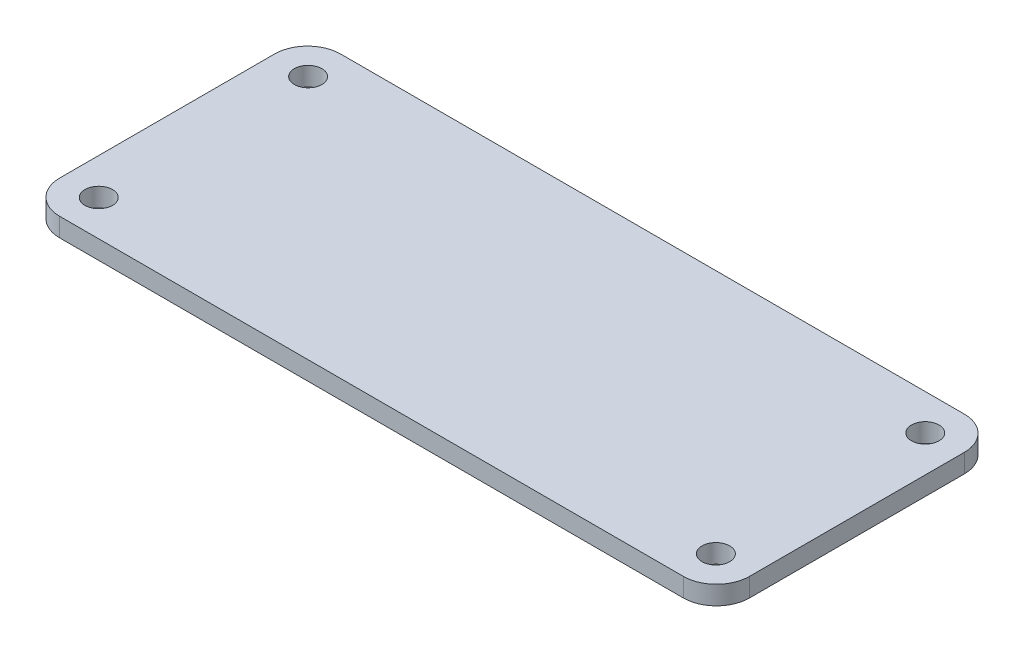
ISO-10303-21;
HEADER;
FILE_DESCRIPTION(('STEP AP214'),'2;1');
FILE_NAME('part.step','',(''),(''),'','','');
FILE_SCHEMA(('AUTOMOTIVE_DESIGN { 1 0 10303 214 1 1 1 1 }'));
ENDSEC;
DATA;
#1=APPLICATION_CONTEXT('core data for automotive mechanical design processes');
#2=APPLICATION_PROTOCOL_DEFINITION('international standard','automotive_design',2000,#1);
#3=PRODUCT_CONTEXT('',#1,'mechanical');
#4=PRODUCT('Part','Part','',(#3));
#5=PRODUCT_RELATED_PRODUCT_CATEGORY('part','',(#4));
#6=PRODUCT_DEFINITION_FORMATION('','',#4);
#7=PRODUCT_DEFINITION_CONTEXT('part definition',#1,'design');
#8=PRODUCT_DEFINITION('design','',#6,#7);
#9=PRODUCT_DEFINITION_SHAPE('','',#8);
#10=(LENGTH_UNIT() NAMED_UNIT(*) SI_UNIT(.MILLI.,.METRE.));
#11=(NAMED_UNIT(*) PLANE_ANGLE_UNIT() SI_UNIT($,.RADIAN.));
#12=(NAMED_UNIT(*) SI_UNIT($,.STERADIAN.) SOLID_ANGLE_UNIT());
#13=UNCERTAINTY_MEASURE_WITH_UNIT(LENGTH_MEASURE(1.E-05),#10,'distance_accuracy_value','');
#14=(GEOMETRIC_REPRESENTATION_CONTEXT(3) GLOBAL_UNCERTAINTY_ASSIGNED_CONTEXT((#13)) GLOBAL_UNIT_ASSIGNED_CONTEXT((#10,
#11,#12)) REPRESENTATION_CONTEXT('',''));
#15=CARTESIAN_POINT('',(0.,0.,0.));
#16=DIRECTION('',(0.,0.,1.));
#17=DIRECTION('',(1.,0.,0.));
#18=AXIS2_PLACEMENT_3D('',#15,#16,#17);
#19=CARTESIAN_POINT('',(0.,1.7,0.));
#20=DIRECTION('',(0.,1.,0.));
#21=DIRECTION('',(0.,0.,1.));
#22=AXIS2_PLACEMENT_3D('',#19,#20,#21);
#23=PLANE('',#22);
#24=CARTESIAN_POINT('',(28.,1.7,9.5));
#25=DIRECTION('',(0.,1.,0.));
#26=DIRECTION('',(0.,0.,1.));
#27=AXIS2_PLACEMENT_3D('',#24,#25,#26);
#28=CIRCLE('',#27,1.25);
#29=CARTESIAN_POINT('',(28.,1.7,10.75));
#30=VERTEX_POINT('',#29);
#31=EDGE_CURVE('E224',#30,#30,#28,.T.);
#32=ORIENTED_EDGE('',*,*,#31,.F.);
#33=EDGE_LOOP('',(#32));
#34=FACE_BOUND('',#33,.T.);
#35=CARTESIAN_POINT('',(-28.,1.7,-9.5));
#36=DIRECTION('',(0.,1.,0.));
#37=DIRECTION('',(0.,0.,1.));
#38=AXIS2_PLACEMENT_3D('',#35,#36,#37);
#39=CIRCLE('',#38,1.25);
#40=CARTESIAN_POINT('',(-28.,1.7,-8.25));
#41=VERTEX_POINT('',#40);
#42=EDGE_CURVE('E146',#41,#41,#39,.T.);
#43=ORIENTED_EDGE('',*,*,#42,.F.);
#44=EDGE_LOOP('',(#43));
#45=FACE_BOUND('',#44,.T.);
#46=DIRECTION('',(0.,0.,-1.));
#47=VECTOR('',#46,1.);
#48=CARTESIAN_POINT('',(31.3,1.7,-12.75));
#49=LINE('',#48,#47);
#50=CARTESIAN_POINT('',(31.3,1.7,9.75));
#51=VERTEX_POINT('',#50);
#52=CARTESIAN_POINT('',(31.3,1.7,-9.75000000000001));
#53=VERTEX_POINT('',#52);
#54=EDGE_CURVE('E152',#51,#53,#49,.T.);
#55=ORIENTED_EDGE('',*,*,#54,.T.);
#56=CARTESIAN_POINT('',(28.3,1.7,-9.75000000000001));
#57=DIRECTION('',(0.,1.,0.));
#58=DIRECTION('',(0.,0.,1.));
#59=AXIS2_PLACEMENT_3D('',#56,#57,#58);
#60=CIRCLE('',#59,3.);
#61=CARTESIAN_POINT('',(28.3,1.7,-12.75));
#62=VERTEX_POINT('',#61);
#63=EDGE_CURVE('E175',#53,#62,#60,.T.);
#64=ORIENTED_EDGE('',*,*,#63,.T.);
#65=DIRECTION('',(-1.,0.,0.));
#66=VECTOR('',#65,1.);
#67=CARTESIAN_POINT('',(-31.3,1.7,-12.75));
#68=LINE('',#67,#66);
#69=CARTESIAN_POINT('',(-28.3,1.7,-12.75));
#70=VERTEX_POINT('',#69);
#71=EDGE_CURVE('E128',#62,#70,#68,.T.);
#72=ORIENTED_EDGE('',*,*,#71,.T.);
#73=CARTESIAN_POINT('',(-28.3,1.7,-9.75000000000001));
#74=DIRECTION('',(0.,1.,0.));
#75=DIRECTION('',(0.,0.,1.));
#76=AXIS2_PLACEMENT_3D('',#73,#74,#75);
#77=CIRCLE('',#76,3.);
#78=CARTESIAN_POINT('',(-31.3,1.7,-9.75000000000001));
#79=VERTEX_POINT('',#78);
#80=EDGE_CURVE('E169',#70,#79,#77,.T.);
#81=ORIENTED_EDGE('',*,*,#80,.T.);
#82=DIRECTION('',(0.,0.,1.));
#83=VECTOR('',#82,1.);
#84=CARTESIAN_POINT('',(-31.3,1.7,-12.75));
#85=LINE('',#84,#83);
#86=CARTESIAN_POINT('',(-31.3,1.7,9.75));
#87=VERTEX_POINT('',#86);
#88=EDGE_CURVE('E188',#79,#87,#85,.T.);
#89=ORIENTED_EDGE('',*,*,#88,.T.);
#90=CARTESIAN_POINT('',(-28.3,1.7,9.75));
#91=DIRECTION('',(0.,1.,0.));
#92=DIRECTION('',(0.,0.,1.));
#93=AXIS2_PLACEMENT_3D('',#90,#91,#92);
#94=CIRCLE('',#93,3.);
#95=CARTESIAN_POINT('',(-28.3,1.7,12.75));
#96=VERTEX_POINT('',#95);
#97=EDGE_CURVE('E62',#87,#96,#94,.T.);
#98=ORIENTED_EDGE('',*,*,#97,.T.);
#99=DIRECTION('',(1.,0.,0.));
#100=VECTOR('',#99,1.);
#101=CARTESIAN_POINT('',(-31.3,1.7,12.75));
#102=LINE('',#101,#100);
#103=CARTESIAN_POINT('',(28.3,1.7,12.75));
#104=VERTEX_POINT('',#103);
#105=EDGE_CURVE('E154',#96,#104,#102,.T.);
#106=ORIENTED_EDGE('',*,*,#105,.T.);
#107=CARTESIAN_POINT('',(28.3,1.7,9.75));
#108=DIRECTION('',(0.,1.,0.));
#109=DIRECTION('',(0.,0.,1.));
#110=AXIS2_PLACEMENT_3D('',#107,#108,#109);
#111=CIRCLE('',#110,3.);
#112=EDGE_CURVE('E172',#104,#51,#111,.T.);
#113=ORIENTED_EDGE('',*,*,#112,.T.);
#114=EDGE_LOOP('',(#55,#64,#72,#81,#89,#98,#106,#113));
#115=FACE_BOUND('',#114,.T.);
#116=CARTESIAN_POINT('',(28.,1.7,-9.5));
#117=DIRECTION('',(0.,1.,0.));
#118=DIRECTION('',(0.,0.,1.));
#119=AXIS2_PLACEMENT_3D('',#116,#117,#118);
#120=CIRCLE('',#119,1.25);
#121=CARTESIAN_POINT('',(28.,1.7,-8.25));
#122=VERTEX_POINT('',#121);
#123=EDGE_CURVE('E216',#122,#122,#120,.T.);
#124=ORIENTED_EDGE('',*,*,#123,.F.);
#125=EDGE_LOOP('',(#124));
#126=FACE_BOUND('',#125,.T.);
#127=CARTESIAN_POINT('',(-28.,1.7,9.5));
#128=DIRECTION('',(0.,1.,0.));
#129=DIRECTION('',(0.,0.,1.));
#130=AXIS2_PLACEMENT_3D('',#127,#128,#129);
#131=CIRCLE('',#130,1.25);
#132=CARTESIAN_POINT('',(-28.,1.7,10.75));
#133=VERTEX_POINT('',#132);
#134=EDGE_CURVE('E232',#133,#133,#131,.T.);
#135=ORIENTED_EDGE('',*,*,#134,.F.);
#136=EDGE_LOOP('',(#135));
#137=FACE_BOUND('',#136,.T.);
#138=ADVANCED_FACE('F39',(#34,#45,#115,#126,#137),#23,.T.);
#139=CARTESIAN_POINT('',(0.,0.,0.));
#140=DIRECTION('',(0.,1.,0.));
#141=DIRECTION('',(0.,0.,1.));
#142=AXIS2_PLACEMENT_3D('',#139,#140,#141);
#143=PLANE('',#142);
#144=DIRECTION('',(-1.,0.,0.));
#145=VECTOR('',#144,1.);
#146=CARTESIAN_POINT('',(-31.3,0.,-12.75));
#147=LINE('',#146,#145);
#148=CARTESIAN_POINT('',(28.3,0.,-12.75));
#149=VERTEX_POINT('',#148);
#150=CARTESIAN_POINT('',(-28.3,0.,-12.75));
#151=VERTEX_POINT('',#150);
#152=EDGE_CURVE('E125',#149,#151,#147,.T.);
#153=ORIENTED_EDGE('',*,*,#152,.F.);
#154=CARTESIAN_POINT('',(28.3,0.,-9.75000000000001));
#155=DIRECTION('',(0.,1.,0.));
#156=DIRECTION('',(0.,0.,1.));
#157=AXIS2_PLACEMENT_3D('',#154,#155,#156);
#158=CIRCLE('',#157,3.);
#159=CARTESIAN_POINT('',(31.3,0.,-9.75000000000001));
#160=VERTEX_POINT('',#159);
#161=EDGE_CURVE('E107',#149,#160,#158,.F.);
#162=ORIENTED_EDGE('',*,*,#161,.T.);
#163=DIRECTION('',(0.,0.,-1.));
#164=VECTOR('',#163,1.);
#165=CARTESIAN_POINT('',(31.3,0.,-12.75));
#166=LINE('',#165,#164);
#167=CARTESIAN_POINT('',(31.3,0.,9.75));
#168=VERTEX_POINT('',#167);
#169=EDGE_CURVE('E139',#168,#160,#166,.T.);
#170=ORIENTED_EDGE('',*,*,#169,.F.);
#171=CARTESIAN_POINT('',(28.3,0.,9.75));
#172=DIRECTION('',(0.,1.,0.));
#173=DIRECTION('',(0.,0.,1.));
#174=AXIS2_PLACEMENT_3D('',#171,#172,#173);
#175=CIRCLE('',#174,3.);
#176=CARTESIAN_POINT('',(28.3,0.,12.75));
#177=VERTEX_POINT('',#176);
#178=EDGE_CURVE('E119',#168,#177,#175,.F.);
#179=ORIENTED_EDGE('',*,*,#178,.T.);
#180=DIRECTION('',(1.,0.,0.));
#181=VECTOR('',#180,1.);
#182=CARTESIAN_POINT('',(-31.3,0.,12.75));
#183=LINE('',#182,#181);
#184=CARTESIAN_POINT('',(-28.3,0.,12.75));
#185=VERTEX_POINT('',#184);
#186=EDGE_CURVE('E144',#185,#177,#183,.T.);
#187=ORIENTED_EDGE('',*,*,#186,.F.);
#188=CARTESIAN_POINT('',(-28.3,0.,9.75));
#189=DIRECTION('',(0.,1.,0.));
#190=DIRECTION('',(0.,0.,1.));
#191=AXIS2_PLACEMENT_3D('',#188,#189,#190);
#192=CIRCLE('',#191,3.);
#193=CARTESIAN_POINT('',(-31.3,0.,9.75));
#194=VERTEX_POINT('',#193);
#195=EDGE_CURVE('E130',#185,#194,#192,.F.);
#196=ORIENTED_EDGE('',*,*,#195,.T.);
#197=DIRECTION('',(0.,0.,1.));
#198=VECTOR('',#197,1.);
#199=CARTESIAN_POINT('',(-31.3,0.,-12.75));
#200=LINE('',#199,#198);
#201=CARTESIAN_POINT('',(-31.3,0.,-9.75000000000001));
#202=VERTEX_POINT('',#201);
#203=EDGE_CURVE('E138',#202,#194,#200,.T.);
#204=ORIENTED_EDGE('',*,*,#203,.F.);
#205=CARTESIAN_POINT('',(-28.3,0.,-9.75000000000001));
#206=DIRECTION('',(0.,1.,0.));
#207=DIRECTION('',(0.,0.,1.));
#208=AXIS2_PLACEMENT_3D('',#205,#206,#207);
#209=CIRCLE('',#208,3.);
#210=EDGE_CURVE('E136',#202,#151,#209,.F.);
#211=ORIENTED_EDGE('',*,*,#210,.T.);
#212=EDGE_LOOP('',(#153,#162,#170,#179,#187,#196,#204,#211));
#213=FACE_BOUND('',#212,.T.);
#214=CARTESIAN_POINT('',(-28.,0.,-9.5));
#215=DIRECTION('',(0.,1.,0.));
#216=DIRECTION('',(0.,0.,1.));
#217=AXIS2_PLACEMENT_3D('',#214,#215,#216);
#218=CIRCLE('',#217,1.25);
#219=CARTESIAN_POINT('',(-28.,0.,-8.25));
#220=VERTEX_POINT('',#219);
#221=EDGE_CURVE('E211',#220,#220,#218,.T.);
#222=ORIENTED_EDGE('',*,*,#221,.T.);
#223=EDGE_LOOP('',(#222));
#224=FACE_BOUND('',#223,.T.);
#225=CARTESIAN_POINT('',(28.,0.,-9.5));
#226=DIRECTION('',(0.,1.,0.));
#227=DIRECTION('',(0.,0.,1.));
#228=AXIS2_PLACEMENT_3D('',#225,#226,#227);
#229=CIRCLE('',#228,1.25);
#230=CARTESIAN_POINT('',(28.,0.,-8.25));
#231=VERTEX_POINT('',#230);
#232=EDGE_CURVE('E220',#231,#231,#229,.T.);
#233=ORIENTED_EDGE('',*,*,#232,.T.);
#234=EDGE_LOOP('',(#233));
#235=FACE_BOUND('',#234,.T.);
#236=CARTESIAN_POINT('',(28.,0.,9.5));
#237=DIRECTION('',(0.,1.,0.));
#238=DIRECTION('',(0.,0.,1.));
#239=AXIS2_PLACEMENT_3D('',#236,#237,#238);
#240=CIRCLE('',#239,1.25);
#241=CARTESIAN_POINT('',(28.,0.,10.75));
#242=VERTEX_POINT('',#241);
#243=EDGE_CURVE('E228',#242,#242,#240,.T.);
#244=ORIENTED_EDGE('',*,*,#243,.T.);
#245=EDGE_LOOP('',(#244));
#246=FACE_BOUND('',#245,.T.);
#247=CARTESIAN_POINT('',(-28.,0.,9.5));
#248=DIRECTION('',(0.,1.,0.));
#249=DIRECTION('',(0.,0.,1.));
#250=AXIS2_PLACEMENT_3D('',#247,#248,#249);
#251=CIRCLE('',#250,1.25);
#252=CARTESIAN_POINT('',(-28.,0.,10.75));
#253=VERTEX_POINT('',#252);
#254=EDGE_CURVE('E236',#253,#253,#251,.T.);
#255=ORIENTED_EDGE('',*,*,#254,.T.);
#256=EDGE_LOOP('',(#255));
#257=FACE_BOUND('',#256,.T.);
#258=ADVANCED_FACE('F133',(#213,#224,#235,#246,#257),#143,.F.);
#259=CARTESIAN_POINT('',(31.3,1.7,-12.75));
#260=DIRECTION('',(-1.,0.,0.));
#261=DIRECTION('',(0.,0.,1.));
#262=AXIS2_PLACEMENT_3D('',#259,#260,#261);
#263=PLANE('',#262);
#264=ORIENTED_EDGE('',*,*,#169,.T.);
#265=DIRECTION('',(0.,-1.,0.));
#266=VECTOR('',#265,1.);
#267=CARTESIAN_POINT('',(31.3,1.7,-9.75000000000001));
#268=LINE('',#267,#266);
#269=EDGE_CURVE('E112',#160,#53,#268,.F.);
#270=ORIENTED_EDGE('',*,*,#269,.T.);
#271=ORIENTED_EDGE('',*,*,#54,.F.);
#272=DIRECTION('',(0.,-1.,0.));
#273=VECTOR('',#272,1.);
#274=CARTESIAN_POINT('',(31.3,1.7,9.75));
#275=LINE('',#274,#273);
#276=EDGE_CURVE('E118',#51,#168,#275,.T.);
#277=ORIENTED_EDGE('',*,*,#276,.T.);
#278=EDGE_LOOP('',(#264,#270,#271,#277));
#279=FACE_BOUND('',#278,.T.);
#280=ADVANCED_FACE('F205',(#279),#263,.F.);
#281=CARTESIAN_POINT('',(-31.3,1.7,-12.75));
#282=DIRECTION('',(0.,0.,1.));
#283=DIRECTION('',(1.,0.,0.));
#284=AXIS2_PLACEMENT_3D('',#281,#282,#283);
#285=PLANE('',#284);
#286=ORIENTED_EDGE('',*,*,#71,.F.);
#287=DIRECTION('',(0.,-1.,0.));
#288=VECTOR('',#287,1.);
#289=CARTESIAN_POINT('',(28.3,1.7,-12.75));
#290=LINE('',#289,#288);
#291=EDGE_CURVE('E111',#62,#149,#290,.T.);
#292=ORIENTED_EDGE('',*,*,#291,.T.);
#293=ORIENTED_EDGE('',*,*,#152,.T.);
#294=DIRECTION('',(0.,-1.,0.));
#295=VECTOR('',#294,1.);
#296=CARTESIAN_POINT('',(-28.3,1.7,-12.75));
#297=LINE('',#296,#295);
#298=EDGE_CURVE('E131',#151,#70,#297,.F.);
#299=ORIENTED_EDGE('',*,*,#298,.T.);
#300=EDGE_LOOP('',(#286,#292,#293,#299));
#301=FACE_BOUND('',#300,.T.);
#302=ADVANCED_FACE('F124',(#301),#285,.F.);
#303=CARTESIAN_POINT('',(-31.3,1.7,-12.75));
#304=DIRECTION('',(1.,0.,0.));
#305=DIRECTION('',(0.,0.,-1.));
#306=AXIS2_PLACEMENT_3D('',#303,#304,#305);
#307=PLANE('',#306);
#308=ORIENTED_EDGE('',*,*,#88,.F.);
#309=DIRECTION('',(0.,-1.,0.));
#310=VECTOR('',#309,1.);
#311=CARTESIAN_POINT('',(-31.3,1.7,-9.75000000000001));
#312=LINE('',#311,#310);
#313=EDGE_CURVE('E11',#79,#202,#312,.T.);
#314=ORIENTED_EDGE('',*,*,#313,.T.);
#315=ORIENTED_EDGE('',*,*,#203,.T.);
#316=DIRECTION('',(0.,-1.,0.));
#317=VECTOR('',#316,1.);
#318=CARTESIAN_POINT('',(-31.3,1.7,9.75));
#319=LINE('',#318,#317);
#320=EDGE_CURVE('E48',#194,#87,#319,.F.);
#321=ORIENTED_EDGE('',*,*,#320,.T.);
#322=EDGE_LOOP('',(#308,#314,#315,#321));
#323=FACE_BOUND('',#322,.T.);
#324=ADVANCED_FACE('F187',(#323),#307,.F.);
#325=CARTESIAN_POINT('',(-31.3,1.7,12.75));
#326=DIRECTION('',(0.,0.,-1.));
#327=DIRECTION('',(-1.,0.,0.));
#328=AXIS2_PLACEMENT_3D('',#325,#326,#327);
#329=PLANE('',#328);
#330=ORIENTED_EDGE('',*,*,#186,.T.);
#331=DIRECTION('',(0.,-1.,0.));
#332=VECTOR('',#331,1.);
#333=CARTESIAN_POINT('',(28.3,1.7,12.75));
#334=LINE('',#333,#332);
#335=EDGE_CURVE('E55',#177,#104,#334,.F.);
#336=ORIENTED_EDGE('',*,*,#335,.T.);
#337=ORIENTED_EDGE('',*,*,#105,.F.);
#338=DIRECTION('',(0.,-1.,0.));
#339=VECTOR('',#338,1.);
#340=CARTESIAN_POINT('',(-28.3,1.7,12.75));
#341=LINE('',#340,#339);
#342=EDGE_CURVE('E178',#96,#185,#341,.T.);
#343=ORIENTED_EDGE('',*,*,#342,.T.);
#344=EDGE_LOOP('',(#330,#336,#337,#343));
#345=FACE_BOUND('',#344,.T.);
#346=ADVANCED_FACE('F198',(#345),#329,.F.);
#347=CARTESIAN_POINT('',(-28.,1.7,-9.5));
#348=DIRECTION('',(0.,-1.,0.));
#349=DIRECTION('',(0.,0.,-1.));
#350=AXIS2_PLACEMENT_3D('',#347,#348,#349);
#351=CYLINDRICAL_SURFACE('',#350,1.25);
#352=ORIENTED_EDGE('',*,*,#42,.T.);
#353=EDGE_LOOP('',(#352));
#354=FACE_BOUND('',#353,.T.);
#355=ORIENTED_EDGE('',*,*,#221,.F.);
#356=EDGE_LOOP('',(#355));
#357=FACE_BOUND('',#356,.T.);
#358=ADVANCED_FACE('F257',(#354,#357),#351,.F.);
#359=CARTESIAN_POINT('',(28.,1.7,-9.5));
#360=DIRECTION('',(0.,-1.,0.));
#361=DIRECTION('',(0.,0.,-1.));
#362=AXIS2_PLACEMENT_3D('',#359,#360,#361);
#363=CYLINDRICAL_SURFACE('',#362,1.25);
#364=ORIENTED_EDGE('',*,*,#123,.T.);
#365=EDGE_LOOP('',(#364));
#366=FACE_BOUND('',#365,.T.);
#367=ORIENTED_EDGE('',*,*,#232,.F.);
#368=EDGE_LOOP('',(#367));
#369=FACE_BOUND('',#368,.T.);
#370=ADVANCED_FACE('F349',(#366,#369),#363,.F.);
#371=CARTESIAN_POINT('',(28.,1.7,9.5));
#372=DIRECTION('',(0.,-1.,0.));
#373=DIRECTION('',(0.,0.,-1.));
#374=AXIS2_PLACEMENT_3D('',#371,#372,#373);
#375=CYLINDRICAL_SURFACE('',#374,1.25);
#376=ORIENTED_EDGE('',*,*,#31,.T.);
#377=EDGE_LOOP('',(#376));
#378=FACE_BOUND('',#377,.T.);
#379=ORIENTED_EDGE('',*,*,#243,.F.);
#380=EDGE_LOOP('',(#379));
#381=FACE_BOUND('',#380,.T.);
#382=ADVANCED_FACE('F340',(#378,#381),#375,.F.);
#383=CARTESIAN_POINT('',(-28.,1.7,9.5));
#384=DIRECTION('',(0.,-1.,0.));
#385=DIRECTION('',(0.,0.,-1.));
#386=AXIS2_PLACEMENT_3D('',#383,#384,#385);
#387=CYLINDRICAL_SURFACE('',#386,1.25);
#388=ORIENTED_EDGE('',*,*,#134,.T.);
#389=EDGE_LOOP('',(#388));
#390=FACE_BOUND('',#389,.T.);
#391=ORIENTED_EDGE('',*,*,#254,.F.);
#392=EDGE_LOOP('',(#391));
#393=FACE_BOUND('',#392,.T.);
#394=ADVANCED_FACE('F244',(#390,#393),#387,.F.);
#395=CARTESIAN_POINT('',(28.3,1.7,-9.75000000000001));
#396=DIRECTION('',(0.,-1.,0.));
#397=DIRECTION('',(0.,0.,-1.));
#398=AXIS2_PLACEMENT_3D('',#395,#396,#397);
#399=CYLINDRICAL_SURFACE('',#398,3.);
#400=ORIENTED_EDGE('',*,*,#63,.F.);
#401=ORIENTED_EDGE('',*,*,#269,.F.);
#402=ORIENTED_EDGE('',*,*,#161,.F.);
#403=ORIENTED_EDGE('',*,*,#291,.F.);
#404=EDGE_LOOP('',(#400,#401,#402,#403));
#405=FACE_BOUND('',#404,.T.);
#406=ADVANCED_FACE('F110',(#405),#399,.T.);
#407=CARTESIAN_POINT('',(28.3,1.7,9.75));
#408=DIRECTION('',(0.,-1.,0.));
#409=DIRECTION('',(0.,0.,-1.));
#410=AXIS2_PLACEMENT_3D('',#407,#408,#409);
#411=CYLINDRICAL_SURFACE('',#410,3.);
#412=ORIENTED_EDGE('',*,*,#112,.F.);
#413=ORIENTED_EDGE('',*,*,#335,.F.);
#414=ORIENTED_EDGE('',*,*,#178,.F.);
#415=ORIENTED_EDGE('',*,*,#276,.F.);
#416=EDGE_LOOP('',(#412,#413,#414,#415));
#417=FACE_BOUND('',#416,.T.);
#418=ADVANCED_FACE('F202',(#417),#411,.T.);
#419=CARTESIAN_POINT('',(-28.3,1.7,-9.75000000000001));
#420=DIRECTION('',(0.,-1.,0.));
#421=DIRECTION('',(0.,0.,-1.));
#422=AXIS2_PLACEMENT_3D('',#419,#420,#421);
#423=CYLINDRICAL_SURFACE('',#422,3.);
#424=ORIENTED_EDGE('',*,*,#80,.F.);
#425=ORIENTED_EDGE('',*,*,#298,.F.);
#426=ORIENTED_EDGE('',*,*,#210,.F.);
#427=ORIENTED_EDGE('',*,*,#313,.F.);
#428=EDGE_LOOP('',(#424,#425,#426,#427));
#429=FACE_BOUND('',#428,.T.);
#430=ADVANCED_FACE('F271',(#429),#423,.T.);
#431=CARTESIAN_POINT('',(-28.3,1.7,9.75));
#432=DIRECTION('',(0.,-1.,0.));
#433=DIRECTION('',(0.,0.,-1.));
#434=AXIS2_PLACEMENT_3D('',#431,#432,#433);
#435=CYLINDRICAL_SURFACE('',#434,3.);
#436=ORIENTED_EDGE('',*,*,#97,.F.);
#437=ORIENTED_EDGE('',*,*,#320,.F.);
#438=ORIENTED_EDGE('',*,*,#195,.F.);
#439=ORIENTED_EDGE('',*,*,#342,.F.);
#440=EDGE_LOOP('',(#436,#437,#438,#439));
#441=FACE_BOUND('',#440,.T.);
#442=ADVANCED_FACE('F41',(#441),#435,.T.);
#443=CLOSED_SHELL('',(#138,#258,#280,#302,#324,#346,#358,#370,#382,#394,#406,#418,#430,#442));
#444=MANIFOLD_SOLID_BREP('B2',#443);
#445=ADVANCED_BREP_SHAPE_REPRESENTATION('',(#18,#444),#14);
#446=SHAPE_DEFINITION_REPRESENTATION(#9,#445);
ENDSEC;
END-ISO-10303-21;
